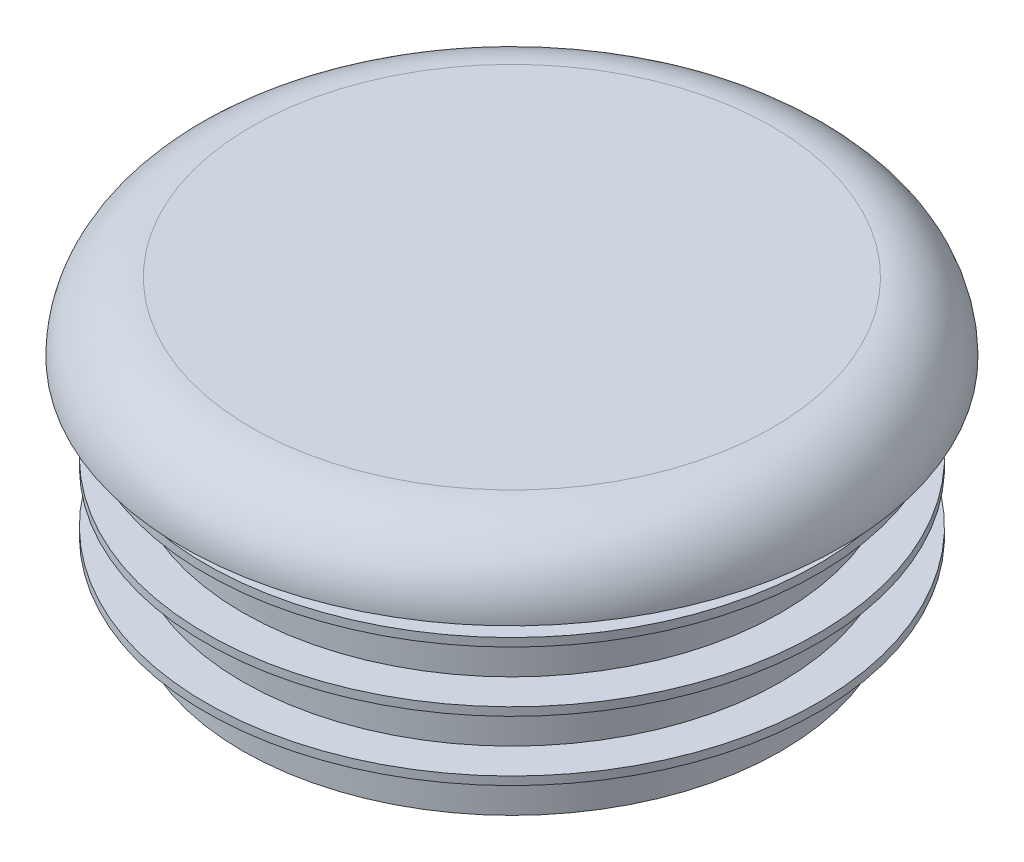
ISO-10303-21;
HEADER;
FILE_DESCRIPTION(('STEP AP214'),'2;1');
FILE_NAME('part.step','',(''),(''),'','','');
FILE_SCHEMA(('AUTOMOTIVE_DESIGN { 1 0 10303 214 1 1 1 1 }'));
ENDSEC;
DATA;
#1=APPLICATION_CONTEXT('core data for automotive mechanical design processes');
#2=APPLICATION_PROTOCOL_DEFINITION('international standard','automotive_design',2000,#1);
#3=PRODUCT_CONTEXT('',#1,'mechanical');
#4=PRODUCT('Part','Part','',(#3));
#5=PRODUCT_RELATED_PRODUCT_CATEGORY('part','',(#4));
#6=PRODUCT_DEFINITION_FORMATION('','',#4);
#7=PRODUCT_DEFINITION_CONTEXT('part definition',#1,'design');
#8=PRODUCT_DEFINITION('design','',#6,#7);
#9=PRODUCT_DEFINITION_SHAPE('','',#8);
#10=(LENGTH_UNIT() NAMED_UNIT(*) SI_UNIT(.MILLI.,.METRE.));
#11=(NAMED_UNIT(*) PLANE_ANGLE_UNIT() SI_UNIT($,.RADIAN.));
#12=(NAMED_UNIT(*) SI_UNIT($,.STERADIAN.) SOLID_ANGLE_UNIT());
#13=UNCERTAINTY_MEASURE_WITH_UNIT(LENGTH_MEASURE(1.E-05),#10,'distance_accuracy_value','');
#14=(GEOMETRIC_REPRESENTATION_CONTEXT(3) GLOBAL_UNCERTAINTY_ASSIGNED_CONTEXT((#13)) GLOBAL_UNIT_ASSIGNED_CONTEXT((#10,
#11,#12)) REPRESENTATION_CONTEXT('',''));
#15=CARTESIAN_POINT('',(0.,0.,0.));
#16=DIRECTION('',(0.,0.,1.));
#17=DIRECTION('',(1.,0.,0.));
#18=AXIS2_PLACEMENT_3D('',#15,#16,#17);
#19=CARTESIAN_POINT('',(0.,53.0457206557912,0.));
#20=DIRECTION('',(0.,-1.,0.));
#21=DIRECTION('',(0.,0.,-1.));
#22=AXIS2_PLACEMENT_3D('',#19,#20,#21);
#23=CYLINDRICAL_SURFACE('',#22,17.1979166666667);
#24=CARTESIAN_POINT('',(0.,-4.97501333333333,0.));
#25=DIRECTION('',(0.,1.,0.));
#26=DIRECTION('',(0.,0.,1.));
#27=AXIS2_PLACEMENT_3D('',#24,#25,#26);
#28=CIRCLE('',#27,17.1979166666667);
#29=CARTESIAN_POINT('',(0.,-4.97501333333333,17.1979166666667));
#30=VERTEX_POINT('',#29);
#31=EDGE_CURVE('E40',#30,#30,#28,.T.);
#32=ORIENTED_EDGE('',*,*,#31,.T.);
#33=EDGE_LOOP('',(#32));
#34=FACE_BOUND('',#33,.T.);
#35=CARTESIAN_POINT('',(0.,-3.25797333333333,0.));
#36=DIRECTION('',(0.,-1.,0.));
#37=DIRECTION('',(0.,0.,-1.));
#38=AXIS2_PLACEMENT_3D('',#35,#36,#37);
#39=CIRCLE('',#38,17.1979166666667);
#40=CARTESIAN_POINT('',(0.,-3.25797333333333,-17.1979166666667));
#41=VERTEX_POINT('',#40);
#42=EDGE_CURVE('E67',#41,#41,#39,.T.);
#43=ORIENTED_EDGE('',*,*,#42,.T.);
#44=EDGE_LOOP('',(#43));
#45=FACE_BOUND('',#44,.T.);
#46=ADVANCED_FACE('F36',(#34,#45),#23,.T.);
#47=CARTESIAN_POINT('',(0.,-1.14469333333333,0.));
#48=DIRECTION('',(0.,1.,0.));
#49=DIRECTION('',(0.,0.,1.));
#50=AXIS2_PLACEMENT_3D('',#47,#48,#49);
#51=CIRCLE('',#50,17.1979166666667);
#52=CARTESIAN_POINT('',(0.,-1.14469333333333,17.1979166666667));
#53=VERTEX_POINT('',#52);
#54=EDGE_CURVE('E52',#53,#53,#51,.T.);
#55=ORIENTED_EDGE('',*,*,#54,.T.);
#56=EDGE_LOOP('',(#55));
#57=FACE_BOUND('',#56,.T.);
#58=CARTESIAN_POINT('',(0.,0.572346666666671,0.));
#59=DIRECTION('',(0.,-1.,0.));
#60=DIRECTION('',(0.,0.,-1.));
#61=AXIS2_PLACEMENT_3D('',#58,#59,#60);
#62=CIRCLE('',#61,17.1979166666667);
#63=CARTESIAN_POINT('',(0.,0.572346666666671,-17.1979166666667));
#64=VERTEX_POINT('',#63);
#65=EDGE_CURVE('E49',#64,#64,#62,.T.);
#66=ORIENTED_EDGE('',*,*,#65,.T.);
#67=EDGE_LOOP('',(#66));
#68=FACE_BOUND('',#67,.T.);
#69=ADVANCED_FACE('F84',(#57,#68),#23,.T.);
#70=CARTESIAN_POINT('',(0.,2.68562666666667,0.));
#71=DIRECTION('',(0.,1.,0.));
#72=DIRECTION('',(0.,0.,1.));
#73=AXIS2_PLACEMENT_3D('',#70,#71,#72);
#74=PLANE('',#73);
#75=CARTESIAN_POINT('',(0.,2.68562666666667,0.));
#76=DIRECTION('',(0.,1.,0.));
#77=DIRECTION('',(0.,0.,1.));
#78=AXIS2_PLACEMENT_3D('',#75,#76,#77);
#79=CIRCLE('',#78,17.1979166666667);
#80=CARTESIAN_POINT('',(0.,2.68562666666667,17.1979166666667));
#81=VERTEX_POINT('',#80);
#82=EDGE_CURVE('E79',#81,#81,#79,.F.);
#83=ORIENTED_EDGE('',*,*,#82,.T.);
#84=EDGE_LOOP('',(#83));
#85=FACE_BOUND('',#84,.T.);
#86=CARTESIAN_POINT('',(0.,2.68562666666667,0.));
#87=DIRECTION('',(0.,-1.,0.));
#88=DIRECTION('',(0.,0.,-1.));
#89=AXIS2_PLACEMENT_3D('',#86,#87,#88);
#90=CIRCLE('',#89,19.5368402125);
#91=CARTESIAN_POINT('',(0.,2.68562666666667,-19.5368402125));
#92=VERTEX_POINT('',#91);
#93=EDGE_CURVE('E11',#92,#92,#90,.T.);
#94=ORIENTED_EDGE('',*,*,#93,.F.);
#95=EDGE_LOOP('',(#94));
#96=FACE_BOUND('',#95,.T.);
#97=ADVANCED_FACE('F38',(#85,#96),#74,.T.);
#98=CARTESIAN_POINT('',(0.,-8.80533333333334,0.));
#99=DIRECTION('',(0.,-1.,0.));
#100=DIRECTION('',(0.,0.,-1.));
#101=AXIS2_PLACEMENT_3D('',#98,#99,#100);
#102=CYLINDRICAL_SURFACE('',#101,19.5368402125);
#103=ORIENTED_EDGE('',*,*,#93,.T.);
#104=EDGE_LOOP('',(#103));
#105=FACE_BOUND('',#104,.T.);
#106=CARTESIAN_POINT('',(0.,2.15730666666667,0.));
#107=DIRECTION('',(0.,-1.,0.));
#108=DIRECTION('',(0.,0.,-1.));
#109=AXIS2_PLACEMENT_3D('',#106,#107,#108);
#110=CIRCLE('',#109,19.5368402125);
#111=CARTESIAN_POINT('',(0.,2.15730666666667,-19.5368402125));
#112=VERTEX_POINT('',#111);
#113=EDGE_CURVE('E44',#112,#112,#110,.T.);
#114=ORIENTED_EDGE('',*,*,#113,.F.);
#115=EDGE_LOOP('',(#114));
#116=FACE_BOUND('',#115,.T.);
#117=ADVANCED_FACE('F89',(#105,#116),#102,.T.);
#118=CARTESIAN_POINT('',(0.,0.572346666666671,0.));
#119=DIRECTION('',(0.,1.,0.));
#120=DIRECTION('',(0.,0.,1.));
#121=AXIS2_PLACEMENT_3D('',#118,#119,#120);
#122=CONICAL_SURFACE('',#121,17.1979166666667,0.97523175413145);
#123=ORIENTED_EDGE('',*,*,#113,.T.);
#124=EDGE_LOOP('',(#123));
#125=FACE_BOUND('',#124,.T.);
#126=ORIENTED_EDGE('',*,*,#65,.F.);
#127=EDGE_LOOP('',(#126));
#128=FACE_BOUND('',#127,.T.);
#129=ADVANCED_FACE('F86',(#125,#128),#122,.T.);
#130=ORIENTED_EDGE('',*,*,#82,.F.);
#131=EDGE_LOOP('',(#130));
#132=FACE_BOUND('',#131,.T.);
#133=CARTESIAN_POINT('',(0.,4.40266666666667,0.));
#134=DIRECTION('',(0.,-1.,0.));
#135=DIRECTION('',(0.,0.,-1.));
#136=AXIS2_PLACEMENT_3D('',#133,#134,#135);
#137=CIRCLE('',#136,17.1979166666667);
#138=CARTESIAN_POINT('',(0.,4.40266666666667,-17.1979166666667));
#139=VERTEX_POINT('',#138);
#140=EDGE_CURVE('E73',#139,#139,#137,.T.);
#141=ORIENTED_EDGE('',*,*,#140,.T.);
#142=EDGE_LOOP('',(#141));
#143=FACE_BOUND('',#142,.T.);
#144=ADVANCED_FACE('F88',(#132,#143),#23,.T.);
#145=CARTESIAN_POINT('',(16.6475833333333,8.80533333333333,0.));
#146=DIRECTION('',(0.,1.,0.));
#147=DIRECTION('',(0.,0.,1.));
#148=AXIS2_PLACEMENT_3D('',#145,#146,#147);
#149=PLANE('',#148);
#150=CARTESIAN_POINT('',(0.,8.80533333333334,0.));
#151=DIRECTION('',(0.,-1.,0.));
#152=DIRECTION('',(0.,0.,-1.));
#153=AXIS2_PLACEMENT_3D('',#150,#151,#152);
#154=CIRCLE('',#153,16.6475833333333);
#155=CARTESIAN_POINT('',(0.,8.80533333333334,-16.6475833333333));
#156=VERTEX_POINT('',#155);
#157=EDGE_CURVE('E59',#156,#156,#154,.T.);
#158=ORIENTED_EDGE('',*,*,#157,.F.);
#159=EDGE_LOOP('',(#158));
#160=FACE_BOUND('',#159,.T.);
#161=ADVANCED_FACE('F96',(#160),#149,.T.);
#162=CARTESIAN_POINT('',(0.,4.40266666666667,0.));
#163=DIRECTION('',(0.,-1.,0.));
#164=DIRECTION('',(0.,0.,-1.));
#165=AXIS2_PLACEMENT_3D('',#162,#163,#164);
#166=TOROIDAL_SURFACE('',#165,16.6475833333333,4.40266666666666);
#167=ORIENTED_EDGE('',*,*,#157,.T.);
#168=EDGE_LOOP('',(#167));
#169=FACE_BOUND('',#168,.T.);
#170=CARTESIAN_POINT('',(0.,4.40266666666667,0.));
#171=DIRECTION('',(0.,-1.,0.));
#172=DIRECTION('',(0.,0.,-1.));
#173=AXIS2_PLACEMENT_3D('',#170,#171,#172);
#174=CIRCLE('',#173,21.05025);
#175=CARTESIAN_POINT('',(0.,4.40266666666667,-21.05025));
#176=VERTEX_POINT('',#175);
#177=EDGE_CURVE('E54',#176,#176,#174,.T.);
#178=ORIENTED_EDGE('',*,*,#177,.F.);
#179=EDGE_LOOP('',(#178));
#180=FACE_BOUND('',#179,.T.);
#181=ADVANCED_FACE('F176',(#169,#180),#166,.T.);
#182=CARTESIAN_POINT('',(0.,4.40266666666667,0.));
#183=DIRECTION('',(0.,-1.,0.));
#184=DIRECTION('',(0.,0.,-1.));
#185=AXIS2_PLACEMENT_3D('',#182,#183,#184);
#186=PLANE('',#185);
#187=ORIENTED_EDGE('',*,*,#140,.F.);
#188=EDGE_LOOP('',(#187));
#189=FACE_BOUND('',#188,.T.);
#190=ORIENTED_EDGE('',*,*,#177,.T.);
#191=EDGE_LOOP('',(#190));
#192=FACE_BOUND('',#191,.T.);
#193=ADVANCED_FACE('F172',(#189,#192),#186,.T.);
#194=CARTESIAN_POINT('',(0.,-1.14469333333333,0.));
#195=DIRECTION('',(0.,1.,0.));
#196=DIRECTION('',(0.,0.,1.));
#197=AXIS2_PLACEMENT_3D('',#194,#195,#196);
#198=PLANE('',#197);
#199=ORIENTED_EDGE('',*,*,#54,.F.);
#200=EDGE_LOOP('',(#199));
#201=FACE_BOUND('',#200,.T.);
#202=CARTESIAN_POINT('',(0.,-1.14469333333333,0.));
#203=DIRECTION('',(0.,-1.,0.));
#204=DIRECTION('',(0.,0.,-1.));
#205=AXIS2_PLACEMENT_3D('',#202,#203,#204);
#206=CIRCLE('',#205,19.5368402125);
#207=CARTESIAN_POINT('',(0.,-1.14469333333333,-19.5368402125));
#208=VERTEX_POINT('',#207);
#209=EDGE_CURVE('E55',#208,#208,#206,.T.);
#210=ORIENTED_EDGE('',*,*,#209,.F.);
#211=EDGE_LOOP('',(#210));
#212=FACE_BOUND('',#211,.T.);
#213=ADVANCED_FACE('F169',(#201,#212),#198,.T.);
#214=CARTESIAN_POINT('',(0.,-12.6356533333333,0.));
#215=DIRECTION('',(0.,-1.,0.));
#216=DIRECTION('',(0.,0.,-1.));
#217=AXIS2_PLACEMENT_3D('',#214,#215,#216);
#218=CYLINDRICAL_SURFACE('',#217,19.5368402125);
#219=ORIENTED_EDGE('',*,*,#209,.T.);
#220=EDGE_LOOP('',(#219));
#221=FACE_BOUND('',#220,.T.);
#222=CARTESIAN_POINT('',(0.,-1.67301333333333,0.));
#223=DIRECTION('',(0.,-1.,0.));
#224=DIRECTION('',(0.,0.,-1.));
#225=AXIS2_PLACEMENT_3D('',#222,#223,#224);
#226=CIRCLE('',#225,19.5368402125);
#227=CARTESIAN_POINT('',(0.,-1.67301333333333,-19.5368402125));
#228=VERTEX_POINT('',#227);
#229=EDGE_CURVE('E62',#228,#228,#226,.T.);
#230=ORIENTED_EDGE('',*,*,#229,.F.);
#231=EDGE_LOOP('',(#230));
#232=FACE_BOUND('',#231,.T.);
#233=ADVANCED_FACE('F165',(#221,#232),#218,.T.);
#234=CARTESIAN_POINT('',(0.,-3.25797333333333,0.));
#235=DIRECTION('',(0.,1.,0.));
#236=DIRECTION('',(0.,0.,1.));
#237=AXIS2_PLACEMENT_3D('',#234,#235,#236);
#238=CONICAL_SURFACE('',#237,17.1979166666667,0.97523175413145);
#239=ORIENTED_EDGE('',*,*,#229,.T.);
#240=EDGE_LOOP('',(#239));
#241=FACE_BOUND('',#240,.T.);
#242=ORIENTED_EDGE('',*,*,#42,.F.);
#243=EDGE_LOOP('',(#242));
#244=FACE_BOUND('',#243,.T.);
#245=ADVANCED_FACE('F148',(#241,#244),#238,.T.);
#246=CARTESIAN_POINT('',(0.,-4.97501333333333,0.));
#247=DIRECTION('',(0.,1.,0.));
#248=DIRECTION('',(0.,0.,1.));
#249=AXIS2_PLACEMENT_3D('',#246,#247,#248);
#250=PLANE('',#249);
#251=ORIENTED_EDGE('',*,*,#31,.F.);
#252=EDGE_LOOP('',(#251));
#253=FACE_BOUND('',#252,.T.);
#254=CARTESIAN_POINT('',(0.,-4.97501333333333,0.));
#255=DIRECTION('',(0.,-1.,0.));
#256=DIRECTION('',(0.,0.,-1.));
#257=AXIS2_PLACEMENT_3D('',#254,#255,#256);
#258=CIRCLE('',#257,19.5368402125);
#259=CARTESIAN_POINT('',(0.,-4.97501333333333,-19.5368402125));
#260=VERTEX_POINT('',#259);
#261=EDGE_CURVE('E132',#260,#260,#258,.T.);
#262=ORIENTED_EDGE('',*,*,#261,.F.);
#263=EDGE_LOOP('',(#262));
#264=FACE_BOUND('',#263,.T.);
#265=ADVANCED_FACE('F144',(#253,#264),#250,.T.);
#266=CARTESIAN_POINT('',(0.,-16.4659733333333,0.));
#267=DIRECTION('',(0.,-1.,0.));
#268=DIRECTION('',(0.,0.,-1.));
#269=AXIS2_PLACEMENT_3D('',#266,#267,#268);
#270=CYLINDRICAL_SURFACE('',#269,19.5368402125);
#271=ORIENTED_EDGE('',*,*,#261,.T.);
#272=EDGE_LOOP('',(#271));
#273=FACE_BOUND('',#272,.T.);
#274=CARTESIAN_POINT('',(0.,-5.50333333333333,0.));
#275=DIRECTION('',(0.,-1.,0.));
#276=DIRECTION('',(0.,0.,-1.));
#277=AXIS2_PLACEMENT_3D('',#274,#275,#276);
#278=CIRCLE('',#277,19.5368402125);
#279=CARTESIAN_POINT('',(0.,-5.50333333333333,-19.5368402125));
#280=VERTEX_POINT('',#279);
#281=EDGE_CURVE('E128',#280,#280,#278,.T.);
#282=ORIENTED_EDGE('',*,*,#281,.F.);
#283=EDGE_LOOP('',(#282));
#284=FACE_BOUND('',#283,.T.);
#285=ADVANCED_FACE('F147',(#273,#284),#270,.T.);
#286=CARTESIAN_POINT('',(0.,-7.08829333333333,0.));
#287=DIRECTION('',(0.,1.,0.));
#288=DIRECTION('',(0.,0.,1.));
#289=AXIS2_PLACEMENT_3D('',#286,#287,#288);
#290=CONICAL_SURFACE('',#289,17.1979166666667,0.97523175413145);
#291=ORIENTED_EDGE('',*,*,#281,.T.);
#292=EDGE_LOOP('',(#291));
#293=FACE_BOUND('',#292,.T.);
#294=CARTESIAN_POINT('',(0.,-7.08829333333333,0.));
#295=DIRECTION('',(0.,-1.,0.));
#296=DIRECTION('',(0.,0.,-1.));
#297=AXIS2_PLACEMENT_3D('',#294,#295,#296);
#298=CIRCLE('',#297,17.1979166666667);
#299=CARTESIAN_POINT('',(0.,-7.08829333333333,-17.1979166666667));
#300=VERTEX_POINT('',#299);
#301=EDGE_CURVE('E124',#300,#300,#298,.T.);
#302=ORIENTED_EDGE('',*,*,#301,.F.);
#303=EDGE_LOOP('',(#302));
#304=FACE_BOUND('',#303,.T.);
#305=ADVANCED_FACE('F119',(#293,#304),#290,.T.);
#306=CARTESIAN_POINT('',(0.,-8.80533333333334,0.));
#307=DIRECTION('',(0.,1.,0.));
#308=DIRECTION('',(0.,0.,1.));
#309=AXIS2_PLACEMENT_3D('',#306,#307,#308);
#310=PLANE('',#309);
#311=CARTESIAN_POINT('',(0.,-8.80533333333334,0.));
#312=DIRECTION('',(0.,-1.,0.));
#313=DIRECTION('',(0.,0.,-1.));
#314=AXIS2_PLACEMENT_3D('',#311,#312,#313);
#315=CIRCLE('',#314,16.09725);
#316=CARTESIAN_POINT('',(0.,-8.80533333333334,-16.09725));
#317=VERTEX_POINT('',#316);
#318=EDGE_CURVE('E135',#317,#317,#315,.T.);
#319=ORIENTED_EDGE('',*,*,#318,.F.);
#320=EDGE_LOOP('',(#319));
#321=FACE_BOUND('',#320,.T.);
#322=CARTESIAN_POINT('',(0.,-8.80533333333334,0.));
#323=DIRECTION('',(0.,1.,0.));
#324=DIRECTION('',(0.,0.,1.));
#325=AXIS2_PLACEMENT_3D('',#322,#323,#324);
#326=CIRCLE('',#325,17.1979166666667);
#327=CARTESIAN_POINT('',(0.,-8.80533333333334,17.1979166666667));
#328=VERTEX_POINT('',#327);
#329=EDGE_CURVE('E76',#328,#328,#326,.T.);
#330=ORIENTED_EDGE('',*,*,#329,.F.);
#331=EDGE_LOOP('',(#330));
#332=FACE_BOUND('',#331,.T.);
#333=ADVANCED_FACE('F110',(#321,#332),#310,.F.);
#334=ORIENTED_EDGE('',*,*,#301,.T.);
#335=EDGE_LOOP('',(#334));
#336=FACE_BOUND('',#335,.T.);
#337=ORIENTED_EDGE('',*,*,#329,.T.);
#338=EDGE_LOOP('',(#337));
#339=FACE_BOUND('',#338,.T.);
#340=ADVANCED_FACE('F99',(#336,#339),#23,.T.);
#341=CARTESIAN_POINT('',(16.6475833333333,5.87022222222223,0.));
#342=DIRECTION('',(0.,1.,0.));
#343=DIRECTION('',(0.,0.,1.));
#344=AXIS2_PLACEMENT_3D('',#341,#342,#343);
#345=PLANE('',#344);
#346=CARTESIAN_POINT('',(0.,5.87022222222223,0.));
#347=DIRECTION('',(0.,1.,0.));
#348=DIRECTION('',(0.,0.,1.));
#349=AXIS2_PLACEMENT_3D('',#346,#347,#348);
#350=CIRCLE('',#349,16.09725);
#351=CARTESIAN_POINT('',(0.,5.87022222222223,16.09725));
#352=VERTEX_POINT('',#351);
#353=EDGE_CURVE('E129',#352,#352,#350,.F.);
#354=ORIENTED_EDGE('',*,*,#353,.T.);
#355=EDGE_LOOP('',(#354));
#356=FACE_BOUND('',#355,.T.);
#357=ADVANCED_FACE('F109',(#356),#345,.F.);
#358=CARTESIAN_POINT('',(0.,54.335231867154,0.));
#359=DIRECTION('',(0.,-1.,0.));
#360=DIRECTION('',(0.,0.,-1.));
#361=AXIS2_PLACEMENT_3D('',#358,#359,#360);
#362=CYLINDRICAL_SURFACE('',#361,16.09725);
#363=ORIENTED_EDGE('',*,*,#318,.T.);
#364=EDGE_LOOP('',(#363));
#365=FACE_BOUND('',#364,.T.);
#366=ORIENTED_EDGE('',*,*,#353,.F.);
#367=EDGE_LOOP('',(#366));
#368=FACE_BOUND('',#367,.T.);
#369=ADVANCED_FACE('F116',(#365,#368),#362,.F.);
#370=CLOSED_SHELL('',(#46,#69,#97,#117,#129,#144,#161,#181,#193,#213,#233,#245,#265,#285,#305,
#333,#340,#357,#369));
#371=MANIFOLD_SOLID_BREP('B2',#370);
#372=ADVANCED_BREP_SHAPE_REPRESENTATION('',(#18,#371),#14);
#373=SHAPE_DEFINITION_REPRESENTATION(#9,#372);
ENDSEC;
END-ISO-10303-21;
